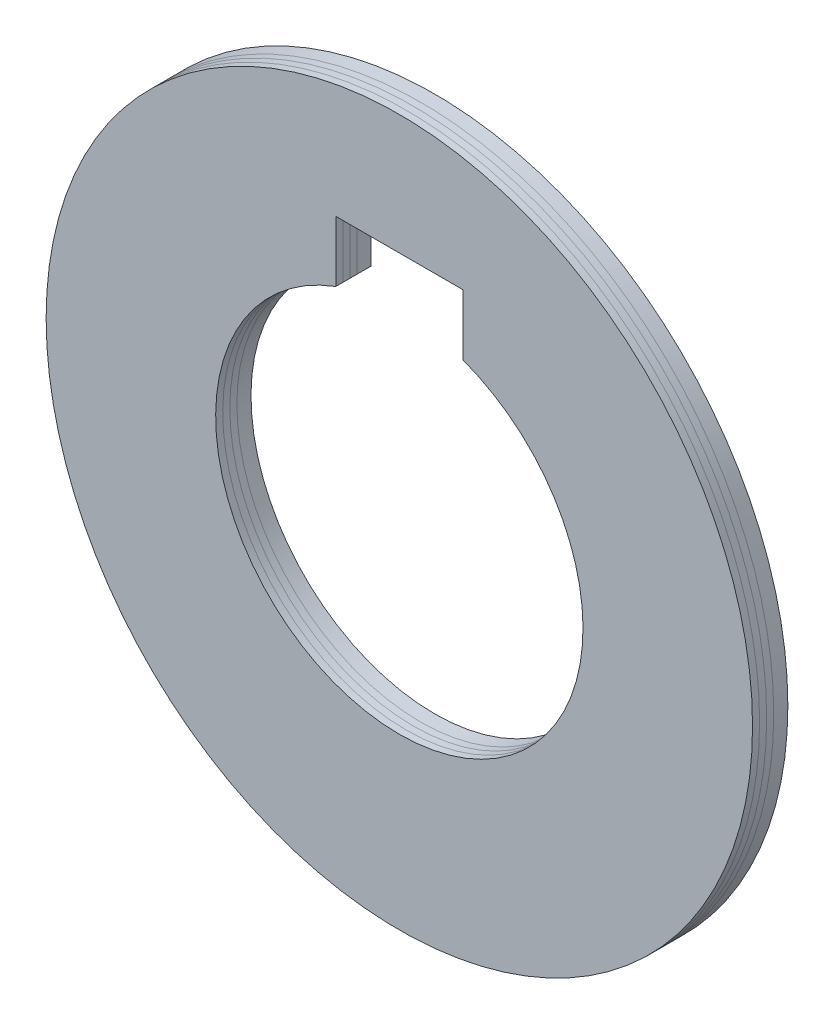
ISO-10303-21;
HEADER;
FILE_DESCRIPTION(('STEP AP214'),'2;1');
FILE_NAME('part.step','',(''),(''),'','','');
FILE_SCHEMA(('AUTOMOTIVE_DESIGN { 1 0 10303 214 1 1 1 1 }'));
ENDSEC;
DATA;
#1=APPLICATION_CONTEXT('core data for automotive mechanical design processes');
#2=APPLICATION_PROTOCOL_DEFINITION('international standard','automotive_design',2000,#1);
#3=PRODUCT_CONTEXT('',#1,'mechanical');
#4=PRODUCT('Part','Part','',(#3));
#5=PRODUCT_RELATED_PRODUCT_CATEGORY('part','',(#4));
#6=PRODUCT_DEFINITION_FORMATION('','',#4);
#7=PRODUCT_DEFINITION_CONTEXT('part definition',#1,'design');
#8=PRODUCT_DEFINITION('design','',#6,#7);
#9=PRODUCT_DEFINITION_SHAPE('','',#8);
#10=(LENGTH_UNIT() NAMED_UNIT(*) SI_UNIT(.MILLI.,.METRE.));
#11=(NAMED_UNIT(*) PLANE_ANGLE_UNIT() SI_UNIT($,.RADIAN.));
#12=(NAMED_UNIT(*) SI_UNIT($,.STERADIAN.) SOLID_ANGLE_UNIT());
#13=UNCERTAINTY_MEASURE_WITH_UNIT(LENGTH_MEASURE(1.E-05),#10,'distance_accuracy_value','');
#14=(GEOMETRIC_REPRESENTATION_CONTEXT(3) GLOBAL_UNCERTAINTY_ASSIGNED_CONTEXT((#13)) GLOBAL_UNIT_ASSIGNED_CONTEXT((#10,
#11,#12)) REPRESENTATION_CONTEXT('',''));
#15=CARTESIAN_POINT('',(0.,0.,0.));
#16=DIRECTION('',(0.,0.,1.));
#17=DIRECTION('',(1.,0.,0.));
#18=AXIS2_PLACEMENT_3D('',#15,#16,#17);
#19=CARTESIAN_POINT('',(-25.,-25.01,1.));
#20=DIRECTION('',(0.,0.,1.));
#21=DIRECTION('',(1.,0.,0.));
#22=AXIS2_PLACEMENT_3D('',#19,#20,#21);
#23=PLANE('',#22);
#24=CARTESIAN_POINT('',(0.,0.,1.));
#25=DIRECTION('',(0.,0.,1.));
#26=DIRECTION('',(1.,0.,0.));
#27=AXIS2_PLACEMENT_3D('',#24,#25,#26);
#28=CIRCLE('',#27,25.);
#29=CARTESIAN_POINT('',(25.,0.,1.));
#30=VERTEX_POINT('',#29);
#31=EDGE_CURVE('E97',#30,#30,#28,.T.);
#32=ORIENTED_EDGE('',*,*,#31,.T.);
#33=EDGE_LOOP('',(#32));
#34=FACE_BOUND('',#33,.T.);
#35=CARTESIAN_POINT('',(0.,0.,1.));
#36=DIRECTION('',(0.,0.,1.));
#37=DIRECTION('',(1.,0.,0.));
#38=AXIS2_PLACEMENT_3D('',#35,#36,#37);
#39=CIRCLE('',#38,13.);
#40=CARTESIAN_POINT('',(-4.5,12.1963109176505,1.));
#41=VERTEX_POINT('',#40);
#42=CARTESIAN_POINT('',(4.5,12.1963109176505,1.));
#43=VERTEX_POINT('',#42);
#44=EDGE_CURVE('E90',#41,#43,#39,.T.);
#45=ORIENTED_EDGE('',*,*,#44,.F.);
#46=DIRECTION('',(0.,-1.,0.));
#47=VECTOR('',#46,1.);
#48=CARTESIAN_POINT('',(-4.5,16.5,1.));
#49=LINE('',#48,#47);
#50=CARTESIAN_POINT('',(-4.5,16.5,1.));
#51=VERTEX_POINT('',#50);
#52=EDGE_CURVE('E104',#51,#41,#49,.T.);
#53=ORIENTED_EDGE('',*,*,#52,.F.);
#54=DIRECTION('',(-1.,0.,0.));
#55=VECTOR('',#54,1.);
#56=CARTESIAN_POINT('',(-4.5,16.5,1.));
#57=LINE('',#56,#55);
#58=CARTESIAN_POINT('',(4.5,16.5,1.));
#59=VERTEX_POINT('',#58);
#60=EDGE_CURVE('E93',#59,#51,#57,.T.);
#61=ORIENTED_EDGE('',*,*,#60,.F.);
#62=DIRECTION('',(0.,1.,0.));
#63=VECTOR('',#62,1.);
#64=CARTESIAN_POINT('',(4.5,16.5,1.));
#65=LINE('',#64,#63);
#66=EDGE_CURVE('E89',#43,#59,#65,.T.);
#67=ORIENTED_EDGE('',*,*,#66,.F.);
#68=EDGE_LOOP('',(#45,#53,#61,#67));
#69=FACE_BOUND('',#68,.T.);
#70=ADVANCED_FACE('F45',(#34,#69),#23,.T.);
#71=CARTESIAN_POINT('',(4.5,16.5,2.5));
#72=DIRECTION('',(-1.,0.,0.));
#73=DIRECTION('',(0.,-1.,0.));
#74=AXIS2_PLACEMENT_3D('',#71,#72,#73);
#75=PLANE('',#74);
#76=DIRECTION('',(0.,0.,-1.));
#77=VECTOR('',#76,1.);
#78=CARTESIAN_POINT('',(4.5,12.1963109176505,2.5));
#79=LINE('',#78,#77);
#80=CARTESIAN_POINT('',(4.5,12.1963109176505,0.));
#81=VERTEX_POINT('',#80);
#82=EDGE_CURVE('E49',#43,#81,#79,.T.);
#83=ORIENTED_EDGE('',*,*,#82,.F.);
#84=ORIENTED_EDGE('',*,*,#66,.T.);
#85=DIRECTION('',(0.,0.,-1.));
#86=VECTOR('',#85,1.);
#87=CARTESIAN_POINT('',(4.5,16.5,2.5));
#88=LINE('',#87,#86);
#89=CARTESIAN_POINT('',(4.5,16.5,0.));
#90=VERTEX_POINT('',#89);
#91=EDGE_CURVE('E68',#59,#90,#88,.T.);
#92=ORIENTED_EDGE('',*,*,#91,.T.);
#93=DIRECTION('',(0.,1.,0.));
#94=VECTOR('',#93,1.);
#95=CARTESIAN_POINT('',(4.5,16.5,0.));
#96=LINE('',#95,#94);
#97=EDGE_CURVE('E54',#81,#90,#96,.T.);
#98=ORIENTED_EDGE('',*,*,#97,.F.);
#99=EDGE_LOOP('',(#83,#84,#92,#98));
#100=FACE_BOUND('',#99,.T.);
#101=ADVANCED_FACE('F99',(#100),#75,.T.);
#102=CARTESIAN_POINT('',(0.,0.,0.));
#103=DIRECTION('',(0.,0.,1.));
#104=DIRECTION('',(1.,0.,0.));
#105=AXIS2_PLACEMENT_3D('',#102,#103,#104);
#106=PLANE('',#105);
#107=CARTESIAN_POINT('',(0.,0.,0.));
#108=DIRECTION('',(0.,0.,1.));
#109=DIRECTION('',(1.,0.,0.));
#110=AXIS2_PLACEMENT_3D('',#107,#108,#109);
#111=CIRCLE('',#110,25.);
#112=CARTESIAN_POINT('',(25.,0.,0.));
#113=VERTEX_POINT('',#112);
#114=EDGE_CURVE('E101',#113,#113,#111,.T.);
#115=ORIENTED_EDGE('',*,*,#114,.F.);
#116=EDGE_LOOP('',(#115));
#117=FACE_BOUND('',#116,.T.);
#118=CARTESIAN_POINT('',(0.,0.,0.));
#119=DIRECTION('',(0.,0.,1.));
#120=DIRECTION('',(1.,0.,0.));
#121=AXIS2_PLACEMENT_3D('',#118,#119,#120);
#122=CIRCLE('',#121,13.);
#123=CARTESIAN_POINT('',(-4.5,12.1963109176505,0.));
#124=VERTEX_POINT('',#123);
#125=EDGE_CURVE('E12',#124,#81,#122,.T.);
#126=ORIENTED_EDGE('',*,*,#125,.T.);
#127=ORIENTED_EDGE('',*,*,#97,.T.);
#128=DIRECTION('',(-1.,0.,0.));
#129=VECTOR('',#128,1.);
#130=CARTESIAN_POINT('',(-4.5,16.5,0.));
#131=LINE('',#130,#129);
#132=CARTESIAN_POINT('',(-4.5,16.5,0.));
#133=VERTEX_POINT('',#132);
#134=EDGE_CURVE('E113',#90,#133,#131,.T.);
#135=ORIENTED_EDGE('',*,*,#134,.T.);
#136=DIRECTION('',(0.,-1.,0.));
#137=VECTOR('',#136,1.);
#138=CARTESIAN_POINT('',(-4.5,16.5,0.));
#139=LINE('',#138,#137);
#140=EDGE_CURVE('E110',#133,#124,#139,.T.);
#141=ORIENTED_EDGE('',*,*,#140,.T.);
#142=EDGE_LOOP('',(#126,#127,#135,#141));
#143=FACE_BOUND('',#142,.T.);
#144=ADVANCED_FACE('F128',(#117,#143),#106,.F.);
#145=CARTESIAN_POINT('',(0.,0.,2.5));
#146=DIRECTION('',(0.,0.,-1.));
#147=DIRECTION('',(-1.,0.,0.));
#148=AXIS2_PLACEMENT_3D('',#145,#146,#147);
#149=CYLINDRICAL_SURFACE('',#148,13.);
#150=DIRECTION('',(0.,0.,-1.));
#151=VECTOR('',#150,1.);
#152=CARTESIAN_POINT('',(-4.5,12.1963109176505,2.5));
#153=LINE('',#152,#151);
#154=EDGE_CURVE('E96',#41,#124,#153,.T.);
#155=ORIENTED_EDGE('',*,*,#154,.F.);
#156=ORIENTED_EDGE('',*,*,#44,.T.);
#157=ORIENTED_EDGE('',*,*,#82,.T.);
#158=ORIENTED_EDGE('',*,*,#125,.F.);
#159=EDGE_LOOP('',(#155,#156,#157,#158));
#160=FACE_BOUND('',#159,.T.);
#161=ADVANCED_FACE('F95',(#160),#149,.F.);
#162=CARTESIAN_POINT('',(-4.5,16.5,2.5));
#163=DIRECTION('',(0.,-1.,0.));
#164=DIRECTION('',(0.,0.,-1.));
#165=AXIS2_PLACEMENT_3D('',#162,#163,#164);
#166=PLANE('',#165);
#167=ORIENTED_EDGE('',*,*,#91,.F.);
#168=ORIENTED_EDGE('',*,*,#60,.T.);
#169=DIRECTION('',(0.,0.,-1.));
#170=VECTOR('',#169,1.);
#171=CARTESIAN_POINT('',(-4.5,16.5,2.5));
#172=LINE('',#171,#170);
#173=EDGE_CURVE('E102',#51,#133,#172,.T.);
#174=ORIENTED_EDGE('',*,*,#173,.T.);
#175=ORIENTED_EDGE('',*,*,#134,.F.);
#176=EDGE_LOOP('',(#167,#168,#174,#175));
#177=FACE_BOUND('',#176,.T.);
#178=ADVANCED_FACE('F124',(#177),#166,.T.);
#179=CARTESIAN_POINT('',(-4.5,16.5,2.5));
#180=DIRECTION('',(1.,0.,0.));
#181=DIRECTION('',(0.,1.,0.));
#182=AXIS2_PLACEMENT_3D('',#179,#180,#181);
#183=PLANE('',#182);
#184=ORIENTED_EDGE('',*,*,#173,.F.);
#185=ORIENTED_EDGE('',*,*,#52,.T.);
#186=ORIENTED_EDGE('',*,*,#154,.T.);
#187=ORIENTED_EDGE('',*,*,#140,.F.);
#188=EDGE_LOOP('',(#184,#185,#186,#187));
#189=FACE_BOUND('',#188,.T.);
#190=ADVANCED_FACE('F126',(#189),#183,.T.);
#191=CARTESIAN_POINT('',(0.,0.,2.5));
#192=DIRECTION('',(0.,0.,-1.));
#193=DIRECTION('',(-1.,0.,0.));
#194=AXIS2_PLACEMENT_3D('',#191,#192,#193);
#195=CYLINDRICAL_SURFACE('',#194,25.);
#196=ORIENTED_EDGE('',*,*,#114,.T.);
#197=EDGE_LOOP('',(#196));
#198=FACE_BOUND('',#197,.T.);
#199=ORIENTED_EDGE('',*,*,#31,.F.);
#200=EDGE_LOOP('',(#199));
#201=FACE_BOUND('',#200,.T.);
#202=ADVANCED_FACE('F47',(#198,#201),#195,.T.);
#203=CLOSED_SHELL('',(#70,#101,#144,#161,#178,#190,#202));
#204=MANIFOLD_SOLID_BREP('B2',#203);
#205=CARTESIAN_POINT('',(-25.,-25.01,2.));
#206=DIRECTION('',(0.,0.,1.));
#207=DIRECTION('',(1.,0.,0.));
#208=AXIS2_PLACEMENT_3D('',#205,#206,#207);
#209=PLANE('',#208);
#210=CARTESIAN_POINT('',(0.,0.,2.));
#211=DIRECTION('',(0.,0.,1.));
#212=DIRECTION('',(1.,0.,0.));
#213=AXIS2_PLACEMENT_3D('',#210,#211,#212);
#214=CIRCLE('',#213,13.);
#215=CARTESIAN_POINT('',(-4.5,12.1963109176505,2.));
#216=VERTEX_POINT('',#215);
#217=CARTESIAN_POINT('',(4.5,12.1963109176505,2.));
#218=VERTEX_POINT('',#217);
#219=EDGE_CURVE('E268',#216,#218,#214,.T.);
#220=ORIENTED_EDGE('',*,*,#219,.T.);
#221=DIRECTION('',(0.,1.,0.));
#222=VECTOR('',#221,1.);
#223=CARTESIAN_POINT('',(4.5,16.5,2.));
#224=LINE('',#223,#222);
#225=CARTESIAN_POINT('',(4.5,16.5,2.));
#226=VERTEX_POINT('',#225);
#227=EDGE_CURVE('E255',#218,#226,#224,.T.);
#228=ORIENTED_EDGE('',*,*,#227,.T.);
#229=DIRECTION('',(-1.,0.,0.));
#230=VECTOR('',#229,1.);
#231=CARTESIAN_POINT('',(-4.5,16.5,2.));
#232=LINE('',#231,#230);
#233=CARTESIAN_POINT('',(-4.5,16.5,2.));
#234=VERTEX_POINT('',#233);
#235=EDGE_CURVE('E251',#226,#234,#232,.T.);
#236=ORIENTED_EDGE('',*,*,#235,.T.);
#237=DIRECTION('',(0.,-1.,0.));
#238=VECTOR('',#237,1.);
#239=CARTESIAN_POINT('',(-4.5,16.5,2.));
#240=LINE('',#239,#238);
#241=EDGE_CURVE('E241',#234,#216,#240,.T.);
#242=ORIENTED_EDGE('',*,*,#241,.T.);
#243=EDGE_LOOP('',(#220,#228,#236,#242));
#244=FACE_BOUND('',#243,.T.);
#245=CARTESIAN_POINT('',(0.,0.,2.));
#246=DIRECTION('',(0.,0.,1.));
#247=DIRECTION('',(1.,0.,0.));
#248=AXIS2_PLACEMENT_3D('',#245,#246,#247);
#249=CIRCLE('',#248,25.);
#250=CARTESIAN_POINT('',(25.,0.,2.));
#251=VERTEX_POINT('',#250);
#252=EDGE_CURVE('E270',#251,#251,#249,.T.);
#253=ORIENTED_EDGE('',*,*,#252,.F.);
#254=EDGE_LOOP('',(#253));
#255=FACE_BOUND('',#254,.T.);
#256=ADVANCED_FACE('F199',(#244,#255),#209,.F.);
#257=CARTESIAN_POINT('',(4.5,16.5,2.5));
#258=DIRECTION('',(-1.,0.,0.));
#259=DIRECTION('',(0.,-1.,0.));
#260=AXIS2_PLACEMENT_3D('',#257,#258,#259);
#261=PLANE('',#260);
#262=ORIENTED_EDGE('',*,*,#227,.F.);
#263=DIRECTION('',(0.,0.,-1.));
#264=VECTOR('',#263,1.);
#265=CARTESIAN_POINT('',(4.5,12.1963109176505,2.5));
#266=LINE('',#265,#264);
#267=CARTESIAN_POINT('',(4.5,12.1963109176505,2.5));
#268=VERTEX_POINT('',#267);
#269=EDGE_CURVE('E203',#268,#218,#266,.T.);
#270=ORIENTED_EDGE('',*,*,#269,.F.);
#271=DIRECTION('',(0.,1.,0.));
#272=VECTOR('',#271,1.);
#273=CARTESIAN_POINT('',(4.5,16.5,2.5));
#274=LINE('',#273,#272);
#275=CARTESIAN_POINT('',(4.5,16.5,2.5));
#276=VERTEX_POINT('',#275);
#277=EDGE_CURVE('E208',#268,#276,#274,.T.);
#278=ORIENTED_EDGE('',*,*,#277,.T.);
#279=DIRECTION('',(0.,0.,-1.));
#280=VECTOR('',#279,1.);
#281=CARTESIAN_POINT('',(4.5,16.5,2.5));
#282=LINE('',#281,#280);
#283=EDGE_CURVE('E262',#276,#226,#282,.T.);
#284=ORIENTED_EDGE('',*,*,#283,.T.);
#285=EDGE_LOOP('',(#262,#270,#278,#284));
#286=FACE_BOUND('',#285,.T.);
#287=ADVANCED_FACE('F281',(#286),#261,.T.);
#288=CARTESIAN_POINT('',(0.,0.,2.5));
#289=DIRECTION('',(0.,0.,-1.));
#290=DIRECTION('',(-1.,0.,0.));
#291=AXIS2_PLACEMENT_3D('',#288,#289,#290);
#292=CYLINDRICAL_SURFACE('',#291,13.);
#293=ORIENTED_EDGE('',*,*,#219,.F.);
#294=DIRECTION('',(0.,0.,-1.));
#295=VECTOR('',#294,1.);
#296=CARTESIAN_POINT('',(-4.5,12.1963109176505,2.5));
#297=LINE('',#296,#295);
#298=CARTESIAN_POINT('',(-4.5,12.1963109176505,2.5));
#299=VERTEX_POINT('',#298);
#300=EDGE_CURVE('E247',#299,#216,#297,.T.);
#301=ORIENTED_EDGE('',*,*,#300,.F.);
#302=CARTESIAN_POINT('',(0.,0.,2.5));
#303=DIRECTION('',(0.,0.,1.));
#304=DIRECTION('',(1.,0.,0.));
#305=AXIS2_PLACEMENT_3D('',#302,#303,#304);
#306=CIRCLE('',#305,13.);
#307=EDGE_CURVE('E43',#299,#268,#306,.T.);
#308=ORIENTED_EDGE('',*,*,#307,.T.);
#309=ORIENTED_EDGE('',*,*,#269,.T.);
#310=EDGE_LOOP('',(#293,#301,#308,#309));
#311=FACE_BOUND('',#310,.T.);
#312=ADVANCED_FACE('F280',(#311),#292,.F.);
#313=CARTESIAN_POINT('',(0.,0.,2.5));
#314=DIRECTION('',(0.,0.,1.));
#315=DIRECTION('',(1.,0.,0.));
#316=AXIS2_PLACEMENT_3D('',#313,#314,#315);
#317=PLANE('',#316);
#318=CARTESIAN_POINT('',(0.,0.,2.5));
#319=DIRECTION('',(0.,0.,1.));
#320=DIRECTION('',(1.,0.,0.));
#321=AXIS2_PLACEMENT_3D('',#318,#319,#320);
#322=CIRCLE('',#321,25.);
#323=CARTESIAN_POINT('',(25.,0.,2.5));
#324=VERTEX_POINT('',#323);
#325=EDGE_CURVE('E272',#324,#324,#322,.T.);
#326=ORIENTED_EDGE('',*,*,#325,.T.);
#327=EDGE_LOOP('',(#326));
#328=FACE_BOUND('',#327,.T.);
#329=ORIENTED_EDGE('',*,*,#277,.F.);
#330=ORIENTED_EDGE('',*,*,#307,.F.);
#331=DIRECTION('',(0.,-1.,0.));
#332=VECTOR('',#331,1.);
#333=CARTESIAN_POINT('',(-4.5,16.5,2.5));
#334=LINE('',#333,#332);
#335=CARTESIAN_POINT('',(-4.5,16.5,2.5));
#336=VERTEX_POINT('',#335);
#337=EDGE_CURVE('E264',#336,#299,#334,.T.);
#338=ORIENTED_EDGE('',*,*,#337,.F.);
#339=DIRECTION('',(-1.,0.,0.));
#340=VECTOR('',#339,1.);
#341=CARTESIAN_POINT('',(-4.5,16.5,2.5));
#342=LINE('',#341,#340);
#343=EDGE_CURVE('E260',#276,#336,#342,.T.);
#344=ORIENTED_EDGE('',*,*,#343,.F.);
#345=EDGE_LOOP('',(#329,#330,#338,#344));
#346=FACE_BOUND('',#345,.T.);
#347=ADVANCED_FACE('F283',(#328,#346),#317,.T.);
#348=CARTESIAN_POINT('',(-4.5,16.5,2.5));
#349=DIRECTION('',(0.,-1.,0.));
#350=DIRECTION('',(0.,0.,-1.));
#351=AXIS2_PLACEMENT_3D('',#348,#349,#350);
#352=PLANE('',#351);
#353=ORIENTED_EDGE('',*,*,#235,.F.);
#354=ORIENTED_EDGE('',*,*,#283,.F.);
#355=ORIENTED_EDGE('',*,*,#343,.T.);
#356=DIRECTION('',(0.,0.,-1.));
#357=VECTOR('',#356,1.);
#358=CARTESIAN_POINT('',(-4.5,16.5,2.5));
#359=LINE('',#358,#357);
#360=EDGE_CURVE('E245',#336,#234,#359,.T.);
#361=ORIENTED_EDGE('',*,*,#360,.T.);
#362=EDGE_LOOP('',(#353,#354,#355,#361));
#363=FACE_BOUND('',#362,.T.);
#364=ADVANCED_FACE('F258',(#363),#352,.T.);
#365=CARTESIAN_POINT('',(-4.5,16.5,2.5));
#366=DIRECTION('',(1.,0.,0.));
#367=DIRECTION('',(0.,1.,0.));
#368=AXIS2_PLACEMENT_3D('',#365,#366,#367);
#369=PLANE('',#368);
#370=ORIENTED_EDGE('',*,*,#241,.F.);
#371=ORIENTED_EDGE('',*,*,#360,.F.);
#372=ORIENTED_EDGE('',*,*,#337,.T.);
#373=ORIENTED_EDGE('',*,*,#300,.T.);
#374=EDGE_LOOP('',(#370,#371,#372,#373));
#375=FACE_BOUND('',#374,.T.);
#376=ADVANCED_FACE('F243',(#375),#369,.T.);
#377=CARTESIAN_POINT('',(0.,0.,2.5));
#378=DIRECTION('',(0.,0.,-1.));
#379=DIRECTION('',(-1.,0.,0.));
#380=AXIS2_PLACEMENT_3D('',#377,#378,#379);
#381=CYLINDRICAL_SURFACE('',#380,25.);
#382=ORIENTED_EDGE('',*,*,#252,.T.);
#383=EDGE_LOOP('',(#382));
#384=FACE_BOUND('',#383,.T.);
#385=ORIENTED_EDGE('',*,*,#325,.F.);
#386=EDGE_LOOP('',(#385));
#387=FACE_BOUND('',#386,.T.);
#388=ADVANCED_FACE('F201',(#384,#387),#381,.T.);
#389=CLOSED_SHELL('',(#256,#287,#312,#347,#364,#376,#388));
#390=MANIFOLD_SOLID_BREP('B6',#389);
#391=CARTESIAN_POINT('',(-25.,-25.01,1.));
#392=DIRECTION('',(0.,0.,1.));
#393=DIRECTION('',(1.,0.,0.));
#394=AXIS2_PLACEMENT_3D('',#391,#392,#393);
#395=PLANE('',#394);
#396=CARTESIAN_POINT('',(0.,0.,1.));
#397=DIRECTION('',(0.,0.,1.));
#398=DIRECTION('',(1.,0.,0.));
#399=AXIS2_PLACEMENT_3D('',#396,#397,#398);
#400=CIRCLE('',#399,13.);
#401=CARTESIAN_POINT('',(-4.5,12.1963109176505,1.));
#402=VERTEX_POINT('',#401);
#403=CARTESIAN_POINT('',(4.5,12.1963109176505,1.));
#404=VERTEX_POINT('',#403);
#405=EDGE_CURVE('E414',#402,#404,#400,.T.);
#406=ORIENTED_EDGE('',*,*,#405,.T.);
#407=DIRECTION('',(0.,1.,0.));
#408=VECTOR('',#407,1.);
#409=CARTESIAN_POINT('',(4.5,16.5,1.));
#410=LINE('',#409,#408);
#411=CARTESIAN_POINT('',(4.5,16.5,1.));
#412=VERTEX_POINT('',#411);
#413=EDGE_CURVE('E400',#404,#412,#410,.T.);
#414=ORIENTED_EDGE('',*,*,#413,.T.);
#415=DIRECTION('',(-1.,0.,0.));
#416=VECTOR('',#415,1.);
#417=CARTESIAN_POINT('',(-4.5,16.5,1.));
#418=LINE('',#417,#416);
#419=CARTESIAN_POINT('',(-4.5,16.5,1.));
#420=VERTEX_POINT('',#419);
#421=EDGE_CURVE('E397',#412,#420,#418,.T.);
#422=ORIENTED_EDGE('',*,*,#421,.T.);
#423=DIRECTION('',(0.,-1.,0.));
#424=VECTOR('',#423,1.);
#425=CARTESIAN_POINT('',(-4.5,16.5,1.));
#426=LINE('',#425,#424);
#427=EDGE_CURVE('E356',#420,#402,#426,.T.);
#428=ORIENTED_EDGE('',*,*,#427,.T.);
#429=EDGE_LOOP('',(#406,#414,#422,#428));
#430=FACE_BOUND('',#429,.T.);
#431=CARTESIAN_POINT('',(0.,0.,1.));
#432=DIRECTION('',(0.,0.,1.));
#433=DIRECTION('',(1.,0.,0.));
#434=AXIS2_PLACEMENT_3D('',#431,#432,#433);
#435=CIRCLE('',#434,25.);
#436=CARTESIAN_POINT('',(25.,0.,1.));
#437=VERTEX_POINT('',#436);
#438=EDGE_CURVE('E418',#437,#437,#435,.T.);
#439=ORIENTED_EDGE('',*,*,#438,.F.);
#440=EDGE_LOOP('',(#439));
#441=FACE_BOUND('',#440,.T.);
#442=ADVANCED_FACE('F352',(#430,#441),#395,.F.);
#443=CARTESIAN_POINT('',(-25.,-25.01,1.5));
#444=DIRECTION('',(0.,0.,1.));
#445=DIRECTION('',(1.,0.,0.));
#446=AXIS2_PLACEMENT_3D('',#443,#444,#445);
#447=PLANE('',#446);
#448=CARTESIAN_POINT('',(0.,0.,1.5));
#449=DIRECTION('',(0.,0.,1.));
#450=DIRECTION('',(1.,0.,0.));
#451=AXIS2_PLACEMENT_3D('',#448,#449,#450);
#452=CIRCLE('',#451,25.);
#453=CARTESIAN_POINT('',(25.,0.,1.5));
#454=VERTEX_POINT('',#453);
#455=EDGE_CURVE('E416',#454,#454,#452,.T.);
#456=ORIENTED_EDGE('',*,*,#455,.T.);
#457=EDGE_LOOP('',(#456));
#458=FACE_BOUND('',#457,.T.);
#459=CARTESIAN_POINT('',(0.,0.,1.5));
#460=DIRECTION('',(0.,0.,1.));
#461=DIRECTION('',(1.,0.,0.));
#462=AXIS2_PLACEMENT_3D('',#459,#460,#461);
#463=CIRCLE('',#462,13.);
#464=CARTESIAN_POINT('',(-4.5,12.1963109176505,1.5));
#465=VERTEX_POINT('',#464);
#466=CARTESIAN_POINT('',(4.5,12.1963109176505,1.5));
#467=VERTEX_POINT('',#466);
#468=EDGE_CURVE('E422',#465,#467,#463,.T.);
#469=ORIENTED_EDGE('',*,*,#468,.F.);
#470=DIRECTION('',(0.,-1.,0.));
#471=VECTOR('',#470,1.);
#472=CARTESIAN_POINT('',(-4.5,16.5,1.5));
#473=LINE('',#472,#471);
#474=CARTESIAN_POINT('',(-4.5,16.5,1.5));
#475=VERTEX_POINT('',#474);
#476=EDGE_CURVE('E369',#475,#465,#473,.T.);
#477=ORIENTED_EDGE('',*,*,#476,.F.);
#478=DIRECTION('',(-1.,0.,0.));
#479=VECTOR('',#478,1.);
#480=CARTESIAN_POINT('',(-4.5,16.5,1.5));
#481=LINE('',#480,#479);
#482=CARTESIAN_POINT('',(4.5,16.5,1.5));
#483=VERTEX_POINT('',#482);
#484=EDGE_CURVE('E405',#483,#475,#481,.T.);
#485=ORIENTED_EDGE('',*,*,#484,.F.);
#486=DIRECTION('',(0.,1.,0.));
#487=VECTOR('',#486,1.);
#488=CARTESIAN_POINT('',(4.5,16.5,1.5));
#489=LINE('',#488,#487);
#490=EDGE_CURVE('E427',#467,#483,#489,.T.);
#491=ORIENTED_EDGE('',*,*,#490,.F.);
#492=EDGE_LOOP('',(#469,#477,#485,#491));
#493=FACE_BOUND('',#492,.T.);
#494=ADVANCED_FACE('F434',(#458,#493),#447,.T.);
#495=CARTESIAN_POINT('',(4.5,16.5,2.5));
#496=DIRECTION('',(-1.,0.,0.));
#497=DIRECTION('',(0.,-1.,0.));
#498=AXIS2_PLACEMENT_3D('',#495,#496,#497);
#499=PLANE('',#498);
#500=DIRECTION('',(0.,0.,-1.));
#501=VECTOR('',#500,1.);
#502=CARTESIAN_POINT('',(4.5,12.1963109176505,2.5));
#503=LINE('',#502,#501);
#504=EDGE_CURVE('E408',#467,#404,#503,.T.);
#505=ORIENTED_EDGE('',*,*,#504,.F.);
#506=ORIENTED_EDGE('',*,*,#490,.T.);
#507=DIRECTION('',(0.,0.,-1.));
#508=VECTOR('',#507,1.);
#509=CARTESIAN_POINT('',(4.5,16.5,2.5));
#510=LINE('',#509,#508);
#511=EDGE_CURVE('E406',#483,#412,#510,.T.);
#512=ORIENTED_EDGE('',*,*,#511,.T.);
#513=ORIENTED_EDGE('',*,*,#413,.F.);
#514=EDGE_LOOP('',(#505,#506,#512,#513));
#515=FACE_BOUND('',#514,.T.);
#516=ADVANCED_FACE('F433',(#515),#499,.T.);
#517=CARTESIAN_POINT('',(0.,0.,2.5));
#518=DIRECTION('',(0.,0.,-1.));
#519=DIRECTION('',(-1.,0.,0.));
#520=AXIS2_PLACEMENT_3D('',#517,#518,#519);
#521=CYLINDRICAL_SURFACE('',#520,13.);
#522=DIRECTION('',(0.,0.,-1.));
#523=VECTOR('',#522,1.);
#524=CARTESIAN_POINT('',(-4.5,12.1963109176505,2.5));
#525=LINE('',#524,#523);
#526=EDGE_CURVE('E197',#465,#402,#525,.T.);
#527=ORIENTED_EDGE('',*,*,#526,.F.);
#528=ORIENTED_EDGE('',*,*,#468,.T.);
#529=ORIENTED_EDGE('',*,*,#504,.T.);
#530=ORIENTED_EDGE('',*,*,#405,.F.);
#531=EDGE_LOOP('',(#527,#528,#529,#530));
#532=FACE_BOUND('',#531,.T.);
#533=ADVANCED_FACE('F436',(#532),#521,.F.);
#534=CARTESIAN_POINT('',(-4.5,16.5,2.5));
#535=DIRECTION('',(0.,-1.,0.));
#536=DIRECTION('',(0.,0.,-1.));
#537=AXIS2_PLACEMENT_3D('',#534,#535,#536);
#538=PLANE('',#537);
#539=ORIENTED_EDGE('',*,*,#511,.F.);
#540=ORIENTED_EDGE('',*,*,#484,.T.);
#541=DIRECTION('',(0.,0.,-1.));
#542=VECTOR('',#541,1.);
#543=CARTESIAN_POINT('',(-4.5,16.5,2.5));
#544=LINE('',#543,#542);
#545=EDGE_CURVE('E361',#475,#420,#544,.T.);
#546=ORIENTED_EDGE('',*,*,#545,.T.);
#547=ORIENTED_EDGE('',*,*,#421,.F.);
#548=EDGE_LOOP('',(#539,#540,#546,#547));
#549=FACE_BOUND('',#548,.T.);
#550=ADVANCED_FACE('F404',(#549),#538,.T.);
#551=CARTESIAN_POINT('',(-4.5,16.5,2.5));
#552=DIRECTION('',(1.,0.,0.));
#553=DIRECTION('',(0.,1.,0.));
#554=AXIS2_PLACEMENT_3D('',#551,#552,#553);
#555=PLANE('',#554);
#556=ORIENTED_EDGE('',*,*,#545,.F.);
#557=ORIENTED_EDGE('',*,*,#476,.T.);
#558=ORIENTED_EDGE('',*,*,#526,.T.);
#559=ORIENTED_EDGE('',*,*,#427,.F.);
#560=EDGE_LOOP('',(#556,#557,#558,#559));
#561=FACE_BOUND('',#560,.T.);
#562=ADVANCED_FACE('F391',(#561),#555,.T.);
#563=CARTESIAN_POINT('',(0.,0.,2.5));
#564=DIRECTION('',(0.,0.,-1.));
#565=DIRECTION('',(-1.,0.,0.));
#566=AXIS2_PLACEMENT_3D('',#563,#564,#565);
#567=CYLINDRICAL_SURFACE('',#566,25.);
#568=ORIENTED_EDGE('',*,*,#438,.T.);
#569=EDGE_LOOP('',(#568));
#570=FACE_BOUND('',#569,.T.);
#571=ORIENTED_EDGE('',*,*,#455,.F.);
#572=EDGE_LOOP('',(#571));
#573=FACE_BOUND('',#572,.T.);
#574=ADVANCED_FACE('F354',(#570,#573),#567,.T.);
#575=CLOSED_SHELL('',(#442,#494,#516,#533,#550,#562,#574));
#576=MANIFOLD_SOLID_BREP('B37',#575);
#577=CARTESIAN_POINT('',(-25.,-25.01,1.5));
#578=DIRECTION('',(0.,0.,1.));
#579=DIRECTION('',(1.,0.,0.));
#580=AXIS2_PLACEMENT_3D('',#577,#578,#579);
#581=PLANE('',#580);
#582=CARTESIAN_POINT('',(0.,0.,1.5));
#583=DIRECTION('',(0.,0.,1.));
#584=DIRECTION('',(1.,0.,0.));
#585=AXIS2_PLACEMENT_3D('',#582,#583,#584);
#586=CIRCLE('',#585,13.);
#587=CARTESIAN_POINT('',(-4.5,12.1963109176505,1.5));
#588=VERTEX_POINT('',#587);
#589=CARTESIAN_POINT('',(4.5,12.1963109176505,1.5));
#590=VERTEX_POINT('',#589);
#591=EDGE_CURVE('E566',#588,#590,#586,.T.);
#592=ORIENTED_EDGE('',*,*,#591,.T.);
#593=DIRECTION('',(0.,1.,0.));
#594=VECTOR('',#593,1.);
#595=CARTESIAN_POINT('',(4.5,16.5,1.5));
#596=LINE('',#595,#594);
#597=CARTESIAN_POINT('',(4.5,16.5,1.5));
#598=VERTEX_POINT('',#597);
#599=EDGE_CURVE('E563',#590,#598,#596,.T.);
#600=ORIENTED_EDGE('',*,*,#599,.T.);
#601=DIRECTION('',(-1.,0.,0.));
#602=VECTOR('',#601,1.);
#603=CARTESIAN_POINT('',(-4.5,16.5,1.5));
#604=LINE('',#603,#602);
#605=CARTESIAN_POINT('',(-4.5,16.5,1.5));
#606=VERTEX_POINT('',#605);
#607=EDGE_CURVE('E505',#598,#606,#604,.T.);
#608=ORIENTED_EDGE('',*,*,#607,.T.);
#609=DIRECTION('',(0.,-1.,0.));
#610=VECTOR('',#609,1.);
#611=CARTESIAN_POINT('',(-4.5,16.5,1.5));
#612=LINE('',#611,#610);
#613=EDGE_CURVE('E350',#606,#588,#612,.T.);
#614=ORIENTED_EDGE('',*,*,#613,.T.);
#615=EDGE_LOOP('',(#592,#600,#608,#614));
#616=FACE_BOUND('',#615,.T.);
#617=CARTESIAN_POINT('',(0.,0.,1.5));
#618=DIRECTION('',(0.,0.,1.));
#619=DIRECTION('',(1.,0.,0.));
#620=AXIS2_PLACEMENT_3D('',#617,#618,#619);
#621=CIRCLE('',#620,25.);
#622=CARTESIAN_POINT('',(25.,0.,1.5));
#623=VERTEX_POINT('',#622);
#624=EDGE_CURVE('E568',#623,#623,#621,.T.);
#625=ORIENTED_EDGE('',*,*,#624,.F.);
#626=EDGE_LOOP('',(#625));
#627=FACE_BOUND('',#626,.T.);
#628=ADVANCED_FACE('F496',(#616,#627),#581,.F.);
#629=CARTESIAN_POINT('',(-25.,-25.01,2.));
#630=DIRECTION('',(0.,0.,1.));
#631=DIRECTION('',(1.,0.,0.));
#632=AXIS2_PLACEMENT_3D('',#629,#630,#631);
#633=PLANE('',#632);
#634=CARTESIAN_POINT('',(0.,0.,2.));
#635=DIRECTION('',(0.,0.,1.));
#636=DIRECTION('',(1.,0.,0.));
#637=AXIS2_PLACEMENT_3D('',#634,#635,#636);
#638=CIRCLE('',#637,25.);
#639=CARTESIAN_POINT('',(25.,0.,2.));
#640=VERTEX_POINT('',#639);
#641=EDGE_CURVE('E500',#640,#640,#638,.T.);
#642=ORIENTED_EDGE('',*,*,#641,.T.);
#643=EDGE_LOOP('',(#642));
#644=FACE_BOUND('',#643,.T.);
#645=CARTESIAN_POINT('',(0.,0.,2.));
#646=DIRECTION('',(0.,0.,1.));
#647=DIRECTION('',(1.,0.,0.));
#648=AXIS2_PLACEMENT_3D('',#645,#646,#647);
#649=CIRCLE('',#648,13.);
#650=CARTESIAN_POINT('',(-4.5,12.1963109176505,2.));
#651=VERTEX_POINT('',#650);
#652=CARTESIAN_POINT('',(4.5,12.1963109176505,2.));
#653=VERTEX_POINT('',#652);
#654=EDGE_CURVE('E541',#651,#653,#649,.T.);
#655=ORIENTED_EDGE('',*,*,#654,.F.);
#656=DIRECTION('',(0.,-1.,0.));
#657=VECTOR('',#656,1.);
#658=CARTESIAN_POINT('',(-4.5,16.5,2.));
#659=LINE('',#658,#657);
#660=CARTESIAN_POINT('',(-4.5,16.5,2.));
#661=VERTEX_POINT('',#660);
#662=EDGE_CURVE('E536',#661,#651,#659,.T.);
#663=ORIENTED_EDGE('',*,*,#662,.F.);
#664=DIRECTION('',(-1.,0.,0.));
#665=VECTOR('',#664,1.);
#666=CARTESIAN_POINT('',(-4.5,16.5,2.));
#667=LINE('',#666,#665);
#668=CARTESIAN_POINT('',(4.5,16.5,2.));
#669=VERTEX_POINT('',#668);
#670=EDGE_CURVE('E538',#669,#661,#667,.T.);
#671=ORIENTED_EDGE('',*,*,#670,.F.);
#672=DIRECTION('',(0.,1.,0.));
#673=VECTOR('',#672,1.);
#674=CARTESIAN_POINT('',(4.5,16.5,2.));
#675=LINE('',#674,#673);
#676=EDGE_CURVE('E552',#653,#669,#675,.T.);
#677=ORIENTED_EDGE('',*,*,#676,.F.);
#678=EDGE_LOOP('',(#655,#663,#671,#677));
#679=FACE_BOUND('',#678,.T.);
#680=ADVANCED_FACE('F498',(#644,#679),#633,.T.);
#681=CARTESIAN_POINT('',(4.5,16.5,2.5));
#682=DIRECTION('',(-1.,0.,0.));
#683=DIRECTION('',(0.,-1.,0.));
#684=AXIS2_PLACEMENT_3D('',#681,#682,#683);
#685=PLANE('',#684);
#686=DIRECTION('',(0.,0.,-1.));
#687=VECTOR('',#686,1.);
#688=CARTESIAN_POINT('',(4.5,12.1963109176505,2.5));
#689=LINE('',#688,#687);
#690=EDGE_CURVE('E543',#653,#590,#689,.T.);
#691=ORIENTED_EDGE('',*,*,#690,.F.);
#692=ORIENTED_EDGE('',*,*,#676,.T.);
#693=DIRECTION('',(0.,0.,-1.));
#694=VECTOR('',#693,1.);
#695=CARTESIAN_POINT('',(4.5,16.5,2.5));
#696=LINE('',#695,#694);
#697=EDGE_CURVE('E551',#669,#598,#696,.T.);
#698=ORIENTED_EDGE('',*,*,#697,.T.);
#699=ORIENTED_EDGE('',*,*,#599,.F.);
#700=EDGE_LOOP('',(#691,#692,#698,#699));
#701=FACE_BOUND('',#700,.T.);
#702=ADVANCED_FACE('F575',(#701),#685,.T.);
#703=CARTESIAN_POINT('',(0.,0.,2.5));
#704=DIRECTION('',(0.,0.,-1.));
#705=DIRECTION('',(-1.,0.,0.));
#706=AXIS2_PLACEMENT_3D('',#703,#704,#705);
#707=CYLINDRICAL_SURFACE('',#706,13.);
#708=DIRECTION('',(0.,0.,-1.));
#709=VECTOR('',#708,1.);
#710=CARTESIAN_POINT('',(-4.5,12.1963109176505,2.5));
#711=LINE('',#710,#709);
#712=EDGE_CURVE('E555',#651,#588,#711,.T.);
#713=ORIENTED_EDGE('',*,*,#712,.F.);
#714=ORIENTED_EDGE('',*,*,#654,.T.);
#715=ORIENTED_EDGE('',*,*,#690,.T.);
#716=ORIENTED_EDGE('',*,*,#591,.F.);
#717=EDGE_LOOP('',(#713,#714,#715,#716));
#718=FACE_BOUND('',#717,.T.);
#719=ADVANCED_FACE('F573',(#718),#707,.F.);
#720=CARTESIAN_POINT('',(-4.5,16.5,2.5));
#721=DIRECTION('',(0.,-1.,0.));
#722=DIRECTION('',(0.,0.,-1.));
#723=AXIS2_PLACEMENT_3D('',#720,#721,#722);
#724=PLANE('',#723);
#725=ORIENTED_EDGE('',*,*,#697,.F.);
#726=ORIENTED_EDGE('',*,*,#670,.T.);
#727=DIRECTION('',(0.,0.,-1.));
#728=VECTOR('',#727,1.);
#729=CARTESIAN_POINT('',(-4.5,16.5,2.5));
#730=LINE('',#729,#728);
#731=EDGE_CURVE('E549',#661,#606,#730,.T.);
#732=ORIENTED_EDGE('',*,*,#731,.T.);
#733=ORIENTED_EDGE('',*,*,#607,.F.);
#734=EDGE_LOOP('',(#725,#726,#732,#733));
#735=FACE_BOUND('',#734,.T.);
#736=ADVANCED_FACE('F548',(#735),#724,.T.);
#737=CARTESIAN_POINT('',(-4.5,16.5,2.5));
#738=DIRECTION('',(1.,0.,0.));
#739=DIRECTION('',(0.,1.,0.));
#740=AXIS2_PLACEMENT_3D('',#737,#738,#739);
#741=PLANE('',#740);
#742=ORIENTED_EDGE('',*,*,#731,.F.);
#743=ORIENTED_EDGE('',*,*,#662,.T.);
#744=ORIENTED_EDGE('',*,*,#712,.T.);
#745=ORIENTED_EDGE('',*,*,#613,.F.);
#746=EDGE_LOOP('',(#742,#743,#744,#745));
#747=FACE_BOUND('',#746,.T.);
#748=ADVANCED_FACE('F554',(#747),#741,.T.);
#749=CARTESIAN_POINT('',(0.,0.,2.5));
#750=DIRECTION('',(0.,0.,-1.));
#751=DIRECTION('',(-1.,0.,0.));
#752=AXIS2_PLACEMENT_3D('',#749,#750,#751);
#753=CYLINDRICAL_SURFACE('',#752,25.);
#754=ORIENTED_EDGE('',*,*,#624,.T.);
#755=EDGE_LOOP('',(#754));
#756=FACE_BOUND('',#755,.T.);
#757=ORIENTED_EDGE('',*,*,#641,.F.);
#758=EDGE_LOOP('',(#757));
#759=FACE_BOUND('',#758,.T.);
#760=ADVANCED_FACE('F580',(#756,#759),#753,.T.);
#761=CLOSED_SHELL('',(#628,#680,#702,#719,#736,#748,#760));
#762=MANIFOLD_SOLID_BREP('B191',#761);
#763=ADVANCED_BREP_SHAPE_REPRESENTATION('',(#18,#204,#390,#576,#762),#14);
#764=SHAPE_DEFINITION_REPRESENTATION(#9,#763);
ENDSEC;
END-ISO-10303-21;
